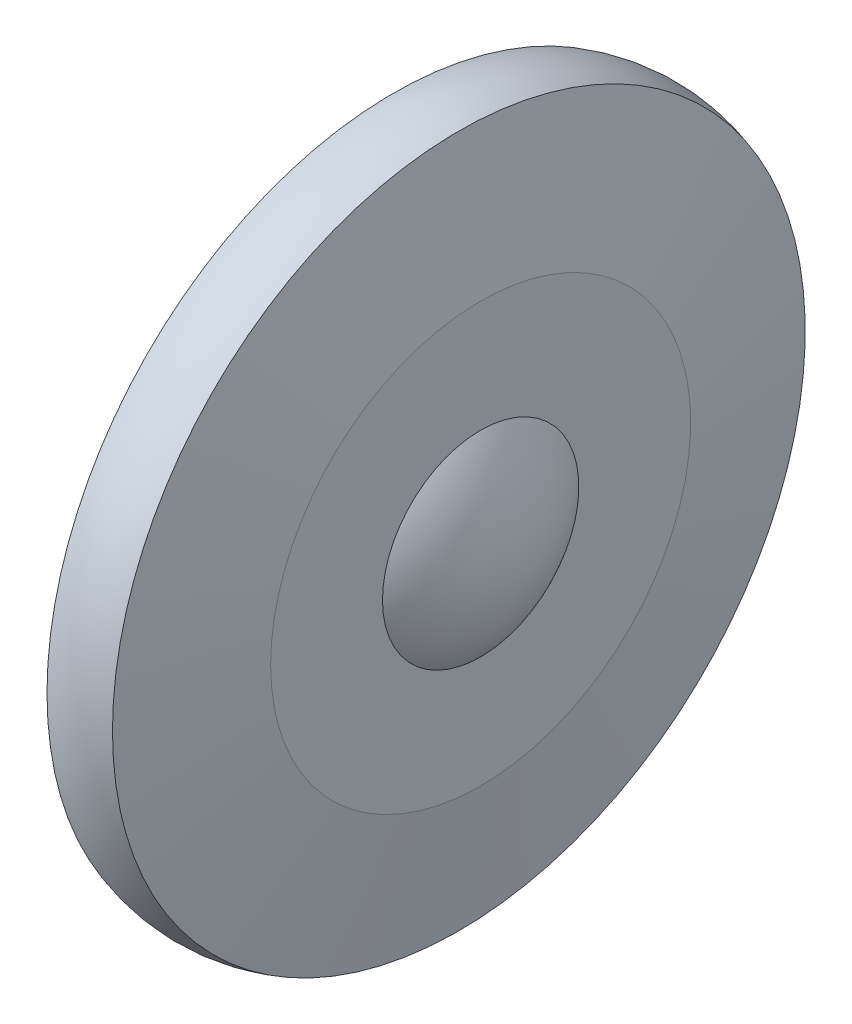
ISO-10303-21;
HEADER;
FILE_DESCRIPTION(('STEP AP214'),'2;1');
FILE_NAME('part.step','',(''),(''),'','','');
FILE_SCHEMA(('AUTOMOTIVE_DESIGN { 1 0 10303 214 1 1 1 1 }'));
ENDSEC;
DATA;
#1=APPLICATION_CONTEXT('core data for automotive mechanical design processes');
#2=APPLICATION_PROTOCOL_DEFINITION('international standard','automotive_design',2000,#1);
#3=PRODUCT_CONTEXT('',#1,'mechanical');
#4=PRODUCT('Part','Part','',(#3));
#5=PRODUCT_RELATED_PRODUCT_CATEGORY('part','',(#4));
#6=PRODUCT_DEFINITION_FORMATION('','',#4);
#7=PRODUCT_DEFINITION_CONTEXT('part definition',#1,'design');
#8=PRODUCT_DEFINITION('design','',#6,#7);
#9=PRODUCT_DEFINITION_SHAPE('','',#8);
#10=(LENGTH_UNIT() NAMED_UNIT(*) SI_UNIT(.MILLI.,.METRE.));
#11=(NAMED_UNIT(*) PLANE_ANGLE_UNIT() SI_UNIT($,.RADIAN.));
#12=(NAMED_UNIT(*) SI_UNIT($,.STERADIAN.) SOLID_ANGLE_UNIT());
#13=UNCERTAINTY_MEASURE_WITH_UNIT(LENGTH_MEASURE(1.E-05),#10,'distance_accuracy_value','');
#14=(GEOMETRIC_REPRESENTATION_CONTEXT(3) GLOBAL_UNCERTAINTY_ASSIGNED_CONTEXT((#13)) GLOBAL_UNIT_ASSIGNED_CONTEXT((#10,
#11,#12)) REPRESENTATION_CONTEXT('',''));
#15=CARTESIAN_POINT('',(0.,0.,0.));
#16=DIRECTION('',(0.,0.,1.));
#17=DIRECTION('',(1.,0.,0.));
#18=AXIS2_PLACEMENT_3D('',#15,#16,#17);
#19=CARTESIAN_POINT('',(-14.,0.,0.));
#20=DIRECTION('',(-1.,0.,0.));
#21=DIRECTION('',(0.,1.,0.));
#22=AXIS2_PLACEMENT_3D('',#19,#20,#21);
#23=SPHERICAL_SURFACE('',#22,26.9072480941474);
#24=CARTESIAN_POINT('',(6.,0.,0.));
#25=DIRECTION('',(-1.,0.,0.));
#26=DIRECTION('',(0.,0.,1.));
#27=AXIS2_PLACEMENT_3D('',#24,#25,#26);
#28=CIRCLE('',#27,18.);
#29=CARTESIAN_POINT('',(6.,0.,18.));
#30=VERTEX_POINT('',#29);
#31=EDGE_CURVE('E82',#30,#30,#28,.T.);
#32=ORIENTED_EDGE('',*,*,#31,.T.);
#33=EDGE_LOOP('',(#32));
#34=FACE_BOUND('',#33,.T.);
#35=ADVANCED_FACE('F32',(#34),#23,.F.);
#36=CARTESIAN_POINT('',(-14.,0.,0.));
#37=DIRECTION('',(-1.,0.,0.));
#38=DIRECTION('',(0.,1.,0.));
#39=AXIS2_PLACEMENT_3D('',#36,#37,#38);
#40=SPHERICAL_SURFACE('',#39,30.);
#41=CARTESIAN_POINT('',(10.,0.,0.));
#42=DIRECTION('',(-1.,0.,0.));
#43=DIRECTION('',(0.,0.,1.));
#44=AXIS2_PLACEMENT_3D('',#41,#42,#43);
#45=CIRCLE('',#44,18.);
#46=CARTESIAN_POINT('',(10.,0.,18.));
#47=VERTEX_POINT('',#46);
#48=EDGE_CURVE('E43',#47,#47,#45,.T.);
#49=ORIENTED_EDGE('',*,*,#48,.F.);
#50=EDGE_LOOP('',(#49));
#51=FACE_BOUND('',#50,.T.);
#52=ADVANCED_FACE('F133',(#51),#40,.T.);
#53=CARTESIAN_POINT('',(10.,38.5,0.));
#54=DIRECTION('',(-1.,0.,0.));
#55=DIRECTION('',(0.,0.,1.));
#56=AXIS2_PLACEMENT_3D('',#53,#54,#55);
#57=PLANE('',#56);
#58=CARTESIAN_POINT('',(10.,0.,0.));
#59=DIRECTION('',(-1.,0.,0.));
#60=DIRECTION('',(0.,0.,1.));
#61=AXIS2_PLACEMENT_3D('',#58,#59,#60);
#62=CIRCLE('',#61,38.5);
#63=CARTESIAN_POINT('',(10.,0.,38.5));
#64=VERTEX_POINT('',#63);
#65=EDGE_CURVE('E47',#64,#64,#62,.T.);
#66=ORIENTED_EDGE('',*,*,#65,.F.);
#67=EDGE_LOOP('',(#66));
#68=FACE_BOUND('',#67,.T.);
#69=ORIENTED_EDGE('',*,*,#48,.T.);
#70=EDGE_LOOP('',(#69));
#71=FACE_BOUND('',#70,.T.);
#72=ADVANCED_FACE('F137',(#68,#71),#57,.F.);
#73=CARTESIAN_POINT('',(10.,0.,0.));
#74=DIRECTION('',(-1.,0.,0.));
#75=DIRECTION('',(0.,0.,1.));
#76=AXIS2_PLACEMENT_3D('',#73,#74,#75);
#77=CONICAL_SURFACE('',#76,38.5,1.4121410646085);
#78=CARTESIAN_POINT('',(6.,0.,0.));
#79=DIRECTION('',(-1.,0.,0.));
#80=DIRECTION('',(0.,0.,1.));
#81=AXIS2_PLACEMENT_3D('',#78,#79,#80);
#82=CIRCLE('',#81,63.5);
#83=CARTESIAN_POINT('',(6.,0.,63.5));
#84=VERTEX_POINT('',#83);
#85=EDGE_CURVE('E52',#84,#84,#82,.T.);
#86=ORIENTED_EDGE('',*,*,#85,.F.);
#87=EDGE_LOOP('',(#86));
#88=FACE_BOUND('',#87,.T.);
#89=ORIENTED_EDGE('',*,*,#65,.T.);
#90=EDGE_LOOP('',(#89));
#91=FACE_BOUND('',#90,.T.);
#92=ADVANCED_FACE('F143',(#88,#91),#77,.T.);
#93=CARTESIAN_POINT('',(0.,0.,0.));
#94=DIRECTION('',(-1.,0.,0.));
#95=DIRECTION('',(0.,0.,1.));
#96=AXIS2_PLACEMENT_3D('',#93,#94,#95);
#97=TOROIDAL_SURFACE('',#96,46.,18.5);
#98=CARTESIAN_POINT('',(-6.,0.,0.));
#99=DIRECTION('',(-1.,0.,0.));
#100=DIRECTION('',(0.,0.,1.));
#101=AXIS2_PLACEMENT_3D('',#98,#99,#100);
#102=CIRCLE('',#101,63.5);
#103=CARTESIAN_POINT('',(-6.,0.,63.5));
#104=VERTEX_POINT('',#103);
#105=EDGE_CURVE('E55',#104,#104,#102,.T.);
#106=ORIENTED_EDGE('',*,*,#105,.F.);
#107=EDGE_LOOP('',(#106));
#108=FACE_BOUND('',#107,.T.);
#109=ORIENTED_EDGE('',*,*,#85,.T.);
#110=EDGE_LOOP('',(#109));
#111=FACE_BOUND('',#110,.T.);
#112=ADVANCED_FACE('F147',(#108,#111),#97,.T.);
#113=CARTESIAN_POINT('',(-6.,0.,0.));
#114=DIRECTION('',(1.,0.,0.));
#115=DIRECTION('',(0.,0.,-1.));
#116=AXIS2_PLACEMENT_3D('',#113,#114,#115);
#117=CONICAL_SURFACE('',#116,63.5,1.4121410646085);
#118=CARTESIAN_POINT('',(-10.,0.,0.));
#119=DIRECTION('',(-1.,0.,0.));
#120=DIRECTION('',(0.,0.,1.));
#121=AXIS2_PLACEMENT_3D('',#118,#119,#120);
#122=CIRCLE('',#121,38.5);
#123=CARTESIAN_POINT('',(-10.,0.,38.5));
#124=VERTEX_POINT('',#123);
#125=EDGE_CURVE('E58',#124,#124,#122,.T.);
#126=ORIENTED_EDGE('',*,*,#125,.F.);
#127=EDGE_LOOP('',(#126));
#128=FACE_BOUND('',#127,.T.);
#129=ORIENTED_EDGE('',*,*,#105,.T.);
#130=EDGE_LOOP('',(#129));
#131=FACE_BOUND('',#130,.T.);
#132=ADVANCED_FACE('F151',(#128,#131),#117,.T.);
#133=CARTESIAN_POINT('',(-10.,29.75,0.));
#134=DIRECTION('',(1.,0.,0.));
#135=DIRECTION('',(0.,0.,-1.));
#136=AXIS2_PLACEMENT_3D('',#133,#134,#135);
#137=PLANE('',#136);
#138=CARTESIAN_POINT('',(-10.,0.,0.));
#139=DIRECTION('',(-1.,0.,0.));
#140=DIRECTION('',(0.,0.,1.));
#141=AXIS2_PLACEMENT_3D('',#138,#139,#140);
#142=CIRCLE('',#141,29.75);
#143=CARTESIAN_POINT('',(-10.,0.,29.75));
#144=VERTEX_POINT('',#143);
#145=EDGE_CURVE('E61',#144,#144,#142,.T.);
#146=ORIENTED_EDGE('',*,*,#145,.F.);
#147=EDGE_LOOP('',(#146));
#148=FACE_BOUND('',#147,.T.);
#149=ORIENTED_EDGE('',*,*,#125,.T.);
#150=EDGE_LOOP('',(#149));
#151=FACE_BOUND('',#150,.T.);
#152=ADVANCED_FACE('F130',(#148,#151),#137,.F.);
#153=CARTESIAN_POINT('',(12.9072480941474,0.,0.));
#154=DIRECTION('',(-1.,0.,0.));
#155=DIRECTION('',(0.,0.,1.));
#156=AXIS2_PLACEMENT_3D('',#153,#154,#155);
#157=CYLINDRICAL_SURFACE('',#156,29.75);
#158=CARTESIAN_POINT('',(-16.,0.,0.));
#159=DIRECTION('',(1.,0.,0.));
#160=DIRECTION('',(0.,0.,-1.));
#161=AXIS2_PLACEMENT_3D('',#158,#159,#160);
#162=CIRCLE('',#161,29.75);
#163=CARTESIAN_POINT('',(-16.,0.,-29.75));
#164=VERTEX_POINT('',#163);
#165=EDGE_CURVE('E10',#164,#164,#162,.T.);
#166=ORIENTED_EDGE('',*,*,#165,.T.);
#167=EDGE_LOOP('',(#166));
#168=FACE_BOUND('',#167,.T.);
#169=ORIENTED_EDGE('',*,*,#145,.T.);
#170=EDGE_LOOP('',(#169));
#171=FACE_BOUND('',#170,.T.);
#172=ADVANCED_FACE('F125',(#168,#171),#157,.T.);
#173=CARTESIAN_POINT('',(-19.,23.5,0.));
#174=DIRECTION('',(1.,0.,0.));
#175=DIRECTION('',(0.,0.,-1.));
#176=AXIS2_PLACEMENT_3D('',#173,#174,#175);
#177=PLANE('',#176);
#178=CARTESIAN_POINT('',(-19.,0.,0.));
#179=DIRECTION('',(1.,0.,0.));
#180=DIRECTION('',(0.,0.,-1.));
#181=AXIS2_PLACEMENT_3D('',#178,#179,#180);
#182=CIRCLE('',#181,26.75);
#183=CARTESIAN_POINT('',(-19.,0.,-26.75));
#184=VERTEX_POINT('',#183);
#185=EDGE_CURVE('E39',#184,#184,#182,.F.);
#186=ORIENTED_EDGE('',*,*,#185,.T.);
#187=EDGE_LOOP('',(#186));
#188=FACE_BOUND('',#187,.T.);
#189=CARTESIAN_POINT('',(-19.,0.,0.));
#190=DIRECTION('',(-1.,0.,0.));
#191=DIRECTION('',(0.,0.,1.));
#192=AXIS2_PLACEMENT_3D('',#189,#190,#191);
#193=CIRCLE('',#192,23.5);
#194=CARTESIAN_POINT('',(-19.,0.,23.5));
#195=VERTEX_POINT('',#194);
#196=EDGE_CURVE('E64',#195,#195,#193,.T.);
#197=ORIENTED_EDGE('',*,*,#196,.F.);
#198=EDGE_LOOP('',(#197));
#199=FACE_BOUND('',#198,.T.);
#200=ADVANCED_FACE('F120',(#188,#199),#177,.F.);
#201=CARTESIAN_POINT('',(12.9072480941474,0.,0.));
#202=DIRECTION('',(-1.,0.,0.));
#203=DIRECTION('',(0.,0.,1.));
#204=AXIS2_PLACEMENT_3D('',#201,#202,#203);
#205=CYLINDRICAL_SURFACE('',#204,23.5);
#206=CARTESIAN_POINT('',(-9.7,0.,0.));
#207=DIRECTION('',(-1.,0.,0.));
#208=DIRECTION('',(0.,0.,1.));
#209=AXIS2_PLACEMENT_3D('',#206,#207,#208);
#210=CIRCLE('',#209,23.5);
#211=CARTESIAN_POINT('',(-9.7,0.,23.5));
#212=VERTEX_POINT('',#211);
#213=EDGE_CURVE('E67',#212,#212,#210,.T.);
#214=ORIENTED_EDGE('',*,*,#213,.F.);
#215=EDGE_LOOP('',(#214));
#216=FACE_BOUND('',#215,.T.);
#217=ORIENTED_EDGE('',*,*,#196,.T.);
#218=EDGE_LOOP('',(#217));
#219=FACE_BOUND('',#218,.T.);
#220=ADVANCED_FACE('F114',(#216,#219),#205,.F.);
#221=CARTESIAN_POINT('',(-9.7,25.5,0.));
#222=DIRECTION('',(-1.,0.,0.));
#223=DIRECTION('',(0.,0.,1.));
#224=AXIS2_PLACEMENT_3D('',#221,#222,#223);
#225=PLANE('',#224);
#226=CARTESIAN_POINT('',(-9.7,0.,0.));
#227=DIRECTION('',(-1.,0.,0.));
#228=DIRECTION('',(0.,0.,1.));
#229=AXIS2_PLACEMENT_3D('',#226,#227,#228);
#230=CIRCLE('',#229,25.5);
#231=CARTESIAN_POINT('',(-9.7,0.,25.5));
#232=VERTEX_POINT('',#231);
#233=EDGE_CURVE('E70',#232,#232,#230,.T.);
#234=ORIENTED_EDGE('',*,*,#233,.F.);
#235=EDGE_LOOP('',(#234));
#236=FACE_BOUND('',#235,.T.);
#237=ORIENTED_EDGE('',*,*,#213,.T.);
#238=EDGE_LOOP('',(#237));
#239=FACE_BOUND('',#238,.T.);
#240=ADVANCED_FACE('F108',(#236,#239),#225,.F.);
#241=CARTESIAN_POINT('',(12.9072480941474,0.,0.));
#242=DIRECTION('',(-1.,0.,0.));
#243=DIRECTION('',(0.,0.,1.));
#244=AXIS2_PLACEMENT_3D('',#241,#242,#243);
#245=CYLINDRICAL_SURFACE('',#244,25.5);
#246=CARTESIAN_POINT('',(-8.,0.,0.));
#247=DIRECTION('',(-1.,0.,0.));
#248=DIRECTION('',(0.,0.,1.));
#249=AXIS2_PLACEMENT_3D('',#246,#247,#248);
#250=CIRCLE('',#249,25.5);
#251=CARTESIAN_POINT('',(-8.,0.,25.5));
#252=VERTEX_POINT('',#251);
#253=EDGE_CURVE('E73',#252,#252,#250,.T.);
#254=ORIENTED_EDGE('',*,*,#253,.F.);
#255=EDGE_LOOP('',(#254));
#256=FACE_BOUND('',#255,.T.);
#257=ORIENTED_EDGE('',*,*,#233,.T.);
#258=EDGE_LOOP('',(#257));
#259=FACE_BOUND('',#258,.T.);
#260=ADVANCED_FACE('F102',(#256,#259),#245,.F.);
#261=CARTESIAN_POINT('',(-8.,23.5,0.));
#262=DIRECTION('',(1.,0.,0.));
#263=DIRECTION('',(0.,0.,-1.));
#264=AXIS2_PLACEMENT_3D('',#261,#262,#263);
#265=PLANE('',#264);
#266=CARTESIAN_POINT('',(-8.,0.,0.));
#267=DIRECTION('',(-1.,0.,0.));
#268=DIRECTION('',(0.,0.,1.));
#269=AXIS2_PLACEMENT_3D('',#266,#267,#268);
#270=CIRCLE('',#269,23.5);
#271=CARTESIAN_POINT('',(-8.,0.,23.5));
#272=VERTEX_POINT('',#271);
#273=EDGE_CURVE('E76',#272,#272,#270,.T.);
#274=ORIENTED_EDGE('',*,*,#273,.F.);
#275=EDGE_LOOP('',(#274));
#276=FACE_BOUND('',#275,.T.);
#277=ORIENTED_EDGE('',*,*,#253,.T.);
#278=EDGE_LOOP('',(#277));
#279=FACE_BOUND('',#278,.T.);
#280=ADVANCED_FACE('F96',(#276,#279),#265,.F.);
#281=CARTESIAN_POINT('',(12.9072480941474,0.,0.));
#282=DIRECTION('',(-1.,0.,0.));
#283=DIRECTION('',(0.,0.,1.));
#284=AXIS2_PLACEMENT_3D('',#281,#282,#283);
#285=CYLINDRICAL_SURFACE('',#284,23.5);
#286=CARTESIAN_POINT('',(6.,0.,0.));
#287=DIRECTION('',(-1.,0.,0.));
#288=DIRECTION('',(0.,0.,1.));
#289=AXIS2_PLACEMENT_3D('',#286,#287,#288);
#290=CIRCLE('',#289,23.5);
#291=CARTESIAN_POINT('',(6.,0.,23.5));
#292=VERTEX_POINT('',#291);
#293=EDGE_CURVE('E79',#292,#292,#290,.T.);
#294=ORIENTED_EDGE('',*,*,#293,.F.);
#295=EDGE_LOOP('',(#294));
#296=FACE_BOUND('',#295,.T.);
#297=ORIENTED_EDGE('',*,*,#273,.T.);
#298=EDGE_LOOP('',(#297));
#299=FACE_BOUND('',#298,.T.);
#300=ADVANCED_FACE('F90',(#296,#299),#285,.F.);
#301=CARTESIAN_POINT('',(6.,18.,0.));
#302=DIRECTION('',(1.,0.,0.));
#303=DIRECTION('',(0.,0.,-1.));
#304=AXIS2_PLACEMENT_3D('',#301,#302,#303);
#305=PLANE('',#304);
#306=ORIENTED_EDGE('',*,*,#31,.F.);
#307=EDGE_LOOP('',(#306));
#308=FACE_BOUND('',#307,.T.);
#309=ORIENTED_EDGE('',*,*,#293,.T.);
#310=EDGE_LOOP('',(#309));
#311=FACE_BOUND('',#310,.T.);
#312=ADVANCED_FACE('F87',(#308,#311),#305,.F.);
#313=CARTESIAN_POINT('',(-19.,0.,0.));
#314=DIRECTION('',(1.,0.,0.));
#315=DIRECTION('',(0.,0.,-1.));
#316=AXIS2_PLACEMENT_3D('',#313,#314,#315);
#317=CONICAL_SURFACE('',#316,26.75,0.785398163397446);
#318=ORIENTED_EDGE('',*,*,#165,.F.);
#319=EDGE_LOOP('',(#318));
#320=FACE_BOUND('',#319,.T.);
#321=ORIENTED_EDGE('',*,*,#185,.F.);
#322=EDGE_LOOP('',(#321));
#323=FACE_BOUND('',#322,.T.);
#324=ADVANCED_FACE('F34',(#320,#323),#317,.T.);
#325=CLOSED_SHELL('',(#35,#52,#72,#92,#112,#132,#152,#172,#200,#220,#240,#260,#280,#300,#312,#324));
#326=MANIFOLD_SOLID_BREP('B2',#325);
#327=ADVANCED_BREP_SHAPE_REPRESENTATION('',(#18,#326),#14);
#328=SHAPE_DEFINITION_REPRESENTATION(#9,#327);
ENDSEC;
END-ISO-10303-21;
